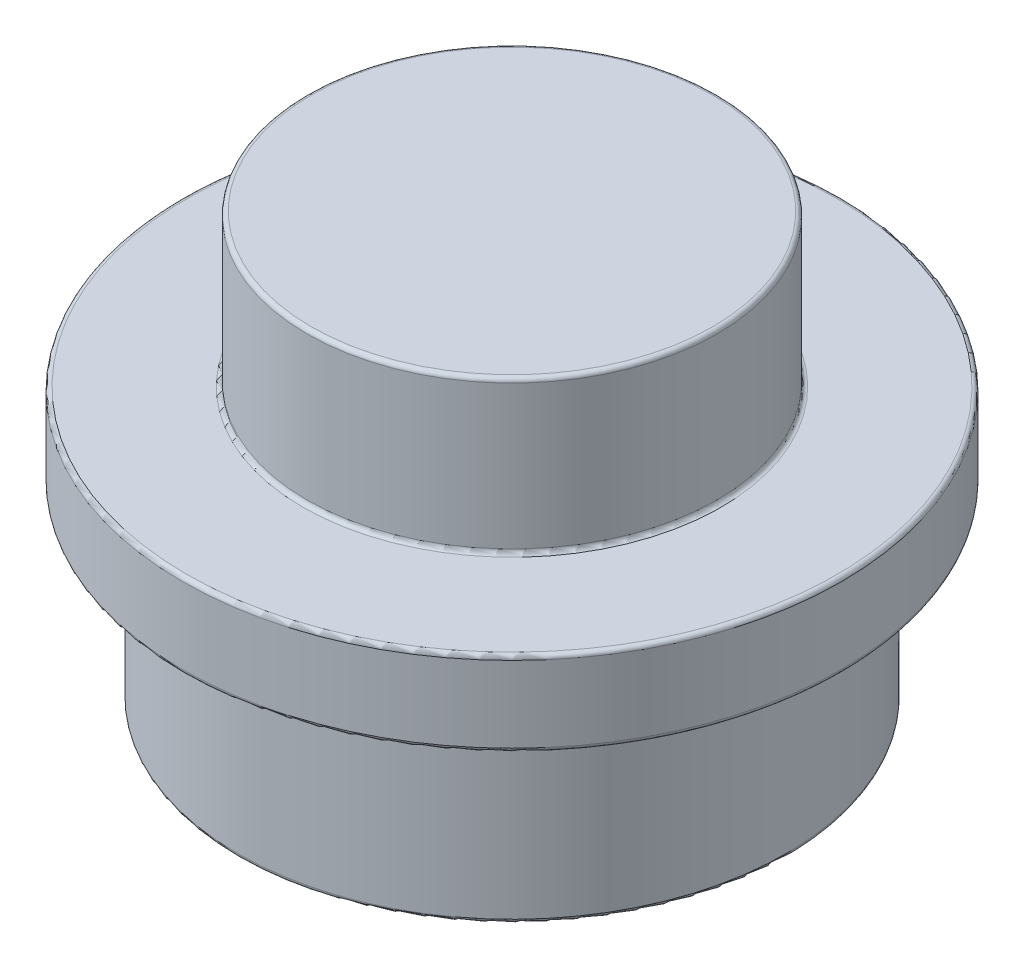
ISO-10303-21;
HEADER;
FILE_DESCRIPTION(('STEP AP214'),'2;1');
FILE_NAME('part.step','',(''),(''),'','','');
FILE_SCHEMA(('AUTOMOTIVE_DESIGN { 1 0 10303 214 1 1 1 1 }'));
ENDSEC;
DATA;
#1=APPLICATION_CONTEXT('core data for automotive mechanical design processes');
#2=APPLICATION_PROTOCOL_DEFINITION('international standard','automotive_design',2000,#1);
#3=PRODUCT_CONTEXT('',#1,'mechanical');
#4=PRODUCT('Part','Part','',(#3));
#5=PRODUCT_RELATED_PRODUCT_CATEGORY('part','',(#4));
#6=PRODUCT_DEFINITION_FORMATION('','',#4);
#7=PRODUCT_DEFINITION_CONTEXT('part definition',#1,'design');
#8=PRODUCT_DEFINITION('design','',#6,#7);
#9=PRODUCT_DEFINITION_SHAPE('','',#8);
#10=(LENGTH_UNIT() NAMED_UNIT(*) SI_UNIT(.MILLI.,.METRE.));
#11=(NAMED_UNIT(*) PLANE_ANGLE_UNIT() SI_UNIT($,.RADIAN.));
#12=(NAMED_UNIT(*) SI_UNIT($,.STERADIAN.) SOLID_ANGLE_UNIT());
#13=UNCERTAINTY_MEASURE_WITH_UNIT(LENGTH_MEASURE(1.E-05),#10,'distance_accuracy_value','');
#14=(GEOMETRIC_REPRESENTATION_CONTEXT(3) GLOBAL_UNCERTAINTY_ASSIGNED_CONTEXT((#13)) GLOBAL_UNIT_ASSIGNED_CONTEXT((#10,
#11,#12)) REPRESENTATION_CONTEXT('',''));
#15=CARTESIAN_POINT('',(0.,0.,0.));
#16=DIRECTION('',(0.,0.,1.));
#17=DIRECTION('',(1.,0.,0.));
#18=AXIS2_PLACEMENT_3D('',#15,#16,#17);
#19=CARTESIAN_POINT('',(0.,0.,0.));
#20=DIRECTION('',(0.,1.,0.));
#21=DIRECTION('',(0.,0.,1.));
#22=AXIS2_PLACEMENT_3D('',#19,#20,#21);
#23=PLANE('',#22);
#24=CARTESIAN_POINT('',(0.,0.,0.));
#25=DIRECTION('',(0.,1.,0.));
#26=DIRECTION('',(0.,0.,1.));
#27=AXIS2_PLACEMENT_3D('',#24,#25,#26);
#28=CIRCLE('',#27,1.74);
#29=CARTESIAN_POINT('',(0.,0.,1.74));
#30=VERTEX_POINT('',#29);
#31=EDGE_CURVE('E86',#30,#30,#28,.T.);
#32=ORIENTED_EDGE('',*,*,#31,.T.);
#33=EDGE_LOOP('',(#32));
#34=FACE_BOUND('',#33,.T.);
#35=CARTESIAN_POINT('',(0.,0.,0.));
#36=DIRECTION('',(0.,1.,0.));
#37=DIRECTION('',(0.,0.,1.));
#38=AXIS2_PLACEMENT_3D('',#35,#36,#37);
#39=CIRCLE('',#38,3.19);
#40=CARTESIAN_POINT('',(0.,0.,3.19));
#41=VERTEX_POINT('',#40);
#42=EDGE_CURVE('E89',#41,#41,#39,.F.);
#43=ORIENTED_EDGE('',*,*,#42,.T.);
#44=EDGE_LOOP('',(#43));
#45=FACE_BOUND('',#44,.T.);
#46=ADVANCED_FACE('F30',(#34,#45),#23,.F.);
#47=CARTESIAN_POINT('',(0.,3.22,0.));
#48=DIRECTION('',(0.,1.,0.));
#49=DIRECTION('',(0.,0.,1.));
#50=AXIS2_PLACEMENT_3D('',#47,#48,#49);
#51=PLANE('',#50);
#52=CARTESIAN_POINT('',(0.,3.22,0.));
#53=DIRECTION('',(0.,1.,0.));
#54=DIRECTION('',(0.,0.,1.));
#55=AXIS2_PLACEMENT_3D('',#52,#53,#54);
#56=CIRCLE('',#55,2.475);
#57=CARTESIAN_POINT('',(0.,3.22,2.475));
#58=VERTEX_POINT('',#57);
#59=EDGE_CURVE('E37',#58,#58,#56,.F.);
#60=ORIENTED_EDGE('',*,*,#59,.T.);
#61=EDGE_LOOP('',(#60));
#62=FACE_BOUND('',#61,.T.);
#63=CARTESIAN_POINT('',(0.,3.22,0.));
#64=DIRECTION('',(0.,1.,0.));
#65=DIRECTION('',(0.,0.,1.));
#66=AXIS2_PLACEMENT_3D('',#63,#64,#65);
#67=CIRCLE('',#66,3.85);
#68=CARTESIAN_POINT('',(0.,3.22,3.85));
#69=VERTEX_POINT('',#68);
#70=EDGE_CURVE('E41',#69,#69,#67,.T.);
#71=ORIENTED_EDGE('',*,*,#70,.T.);
#72=EDGE_LOOP('',(#71));
#73=FACE_BOUND('',#72,.T.);
#74=ADVANCED_FACE('F125',(#62,#73),#51,.T.);
#75=CARTESIAN_POINT('',(0.,3.22,0.));
#76=DIRECTION('',(0.,-1.,0.));
#77=DIRECTION('',(0.,0.,-1.));
#78=AXIS2_PLACEMENT_3D('',#75,#76,#77);
#79=CYLINDRICAL_SURFACE('',#78,3.9);
#80=CARTESIAN_POINT('',(0.,2.27,0.));
#81=DIRECTION('',(0.,1.,0.));
#82=DIRECTION('',(0.,0.,1.));
#83=AXIS2_PLACEMENT_3D('',#80,#81,#82);
#84=CIRCLE('',#83,3.9);
#85=CARTESIAN_POINT('',(0.,2.27,-3.9));
#86=VERTEX_POINT('',#85);
#87=EDGE_CURVE('E59',#86,#86,#84,.T.);
#88=CARTESIAN_POINT('',(0.,3.17,0.));
#89=DIRECTION('',(0.,1.,0.));
#90=DIRECTION('',(0.,0.,1.));
#91=AXIS2_PLACEMENT_3D('',#88,#89,#90);
#92=CIRCLE('',#91,3.9);
#93=CARTESIAN_POINT('',(0.,3.17,-3.9));
#94=VERTEX_POINT('',#93);
#95=EDGE_CURVE('E62',#94,#94,#92,.F.);
#96=CARTESIAN_POINT('',(0.,2.27,-3.9));
#97=CARTESIAN_POINT('',(0.,2.279375,-3.9));
#98=CARTESIAN_POINT('',(0.,2.28875,-3.9));
#99=CARTESIAN_POINT('',(0.,2.3075,-3.9));
#100=CARTESIAN_POINT('',(0.,2.316875,-3.9));
#101=CARTESIAN_POINT('',(0.,2.335625,-3.9));
#102=CARTESIAN_POINT('',(0.,2.345,-3.9));
#103=CARTESIAN_POINT('',(0.,2.36375,-3.9));
#104=CARTESIAN_POINT('',(0.,2.373125,-3.9));
#105=CARTESIAN_POINT('',(0.,2.391875,-3.9));
#106=CARTESIAN_POINT('',(0.,2.40125,-3.9));
#107=CARTESIAN_POINT('',(0.,2.42,-3.9));
#108=CARTESIAN_POINT('',(0.,2.429375,-3.9));
#109=CARTESIAN_POINT('',(0.,2.448125,-3.9));
#110=CARTESIAN_POINT('',(0.,2.4575,-3.9));
#111=CARTESIAN_POINT('',(0.,2.47625,-3.9));
#112=CARTESIAN_POINT('',(0.,2.485625,-3.9));
#113=CARTESIAN_POINT('',(0.,2.504375,-3.9));
#114=CARTESIAN_POINT('',(0.,2.51375,-3.9));
#115=CARTESIAN_POINT('',(0.,2.5325,-3.9));
#116=CARTESIAN_POINT('',(0.,2.541875,-3.9));
#117=CARTESIAN_POINT('',(0.,2.560625,-3.9));
#118=CARTESIAN_POINT('',(0.,2.57,-3.9));
#119=CARTESIAN_POINT('',(0.,2.58875,-3.9));
#120=CARTESIAN_POINT('',(0.,2.598125,-3.9));
#121=CARTESIAN_POINT('',(0.,2.616875,-3.9));
#122=CARTESIAN_POINT('',(0.,2.62625,-3.9));
#123=CARTESIAN_POINT('',(0.,2.645,-3.9));
#124=CARTESIAN_POINT('',(0.,2.654375,-3.9));
#125=CARTESIAN_POINT('',(0.,2.673125,-3.9));
#126=CARTESIAN_POINT('',(0.,2.6825,-3.9));
#127=CARTESIAN_POINT('',(0.,2.70125,-3.9));
#128=CARTESIAN_POINT('',(0.,2.710625,-3.9));
#129=CARTESIAN_POINT('',(0.,2.729375,-3.9));
#130=CARTESIAN_POINT('',(0.,2.73875,-3.9));
#131=CARTESIAN_POINT('',(0.,2.7575,-3.9));
#132=CARTESIAN_POINT('',(0.,2.766875,-3.9));
#133=CARTESIAN_POINT('',(0.,2.785625,-3.9));
#134=CARTESIAN_POINT('',(0.,2.795,-3.9));
#135=CARTESIAN_POINT('',(0.,2.81375,-3.9));
#136=CARTESIAN_POINT('',(0.,2.823125,-3.9));
#137=CARTESIAN_POINT('',(0.,2.841875,-3.9));
#138=CARTESIAN_POINT('',(0.,2.85125,-3.9));
#139=CARTESIAN_POINT('',(0.,2.87,-3.9));
#140=CARTESIAN_POINT('',(0.,2.879375,-3.9));
#141=CARTESIAN_POINT('',(0.,2.898125,-3.9));
#142=CARTESIAN_POINT('',(0.,2.9075,-3.9));
#143=CARTESIAN_POINT('',(0.,2.92625,-3.9));
#144=CARTESIAN_POINT('',(0.,2.935625,-3.9));
#145=CARTESIAN_POINT('',(0.,2.954375,-3.9));
#146=CARTESIAN_POINT('',(0.,2.96375,-3.9));
#147=CARTESIAN_POINT('',(0.,2.9825,-3.9));
#148=CARTESIAN_POINT('',(0.,2.991875,-3.9));
#149=CARTESIAN_POINT('',(0.,3.010625,-3.9));
#150=CARTESIAN_POINT('',(0.,3.02,-3.9));
#151=CARTESIAN_POINT('',(0.,3.03875,-3.9));
#152=CARTESIAN_POINT('',(0.,3.048125,-3.9));
#153=CARTESIAN_POINT('',(0.,3.066875,-3.9));
#154=CARTESIAN_POINT('',(0.,3.07625,-3.9));
#155=CARTESIAN_POINT('',(0.,3.095,-3.9));
#156=CARTESIAN_POINT('',(0.,3.104375,-3.9));
#157=CARTESIAN_POINT('',(0.,3.123125,-3.9));
#158=CARTESIAN_POINT('',(0.,3.1325,-3.9));
#159=CARTESIAN_POINT('',(0.,3.15125,-3.9));
#160=CARTESIAN_POINT('',(0.,3.160625,-3.9));
#161=CARTESIAN_POINT('',(0.,3.17,-3.9));
#162=B_SPLINE_CURVE_WITH_KNOTS('',3,(#96,#97,#98,#99,#100,#101,#102,#103,#104,#105,#106,#107,
#108,#109,#110,#111,#112,#113,#114,#115,#116,#117,#118,#119,#120,#121,#122,#123,#124,#125,#126,
#127,#128,#129,#130,#131,#132,#133,#134,#135,#136,#137,#138,#139,#140,#141,#142,#143,#144,#145,
#146,#147,#148,#149,#150,#151,#152,#153,#154,#155,#156,#157,#158,#159,#160,#161),.UNSPECIFIED.,
.F.,.F.,(4,2,2,2,2,2,2,2,2,2,2,2,2,2,2,2,2,2,2,2,2,2,2,2,2,2,2,2,2,2,2,2,4),(0.,
0.0281249999999999,0.0562500000000003,0.0843750000000003,0.1125,0.140625,0.16875,0.196875,0.225,
0.253125,0.28125,0.309375,0.3375,0.365625,0.39375,0.421875,0.45,0.478125,0.50625,0.534375,
0.5625,0.590625,0.61875,0.646875,0.675,0.703125,0.73125,0.759375,0.7875,0.815625,0.84375,
0.871875,0.9),.UNSPECIFIED.);
#163=EDGE_CURVE('BSEAM131',#86,#94,#162,.T.);
#164=ORIENTED_EDGE('',*,*,#87,.T.);
#165=ORIENTED_EDGE('',*,*,#95,.T.);
#166=ORIENTED_EDGE('',*,*,#163,.T.);
#167=ORIENTED_EDGE('',*,*,#163,.F.);
#168=EDGE_LOOP('',(#164,#166,#165,#167));
#169=FACE_BOUND('',#168,.T.);
#170=ADVANCED_FACE('F131',(#169),#79,.T.);
#171=CARTESIAN_POINT('',(0.,5.02,0.));
#172=DIRECTION('',(0.,-1.,0.));
#173=DIRECTION('',(0.,0.,-1.));
#174=AXIS2_PLACEMENT_3D('',#171,#172,#173);
#175=CYLINDRICAL_SURFACE('',#174,2.425);
#176=CARTESIAN_POINT('',(0.,3.27,0.));
#177=DIRECTION('',(0.,1.,0.));
#178=DIRECTION('',(0.,0.,1.));
#179=AXIS2_PLACEMENT_3D('',#176,#177,#178);
#180=CIRCLE('',#179,2.425);
#181=CARTESIAN_POINT('',(0.,3.27,2.425));
#182=VERTEX_POINT('',#181);
#183=EDGE_CURVE('E45',#182,#182,#180,.T.);
#184=ORIENTED_EDGE('',*,*,#183,.T.);
#185=EDGE_LOOP('',(#184));
#186=FACE_BOUND('',#185,.T.);
#187=CARTESIAN_POINT('',(0.,4.97,0.));
#188=DIRECTION('',(0.,1.,0.));
#189=DIRECTION('',(0.,0.,1.));
#190=AXIS2_PLACEMENT_3D('',#187,#188,#189);
#191=CIRCLE('',#190,2.425);
#192=CARTESIAN_POINT('',(0.,4.97,2.425));
#193=VERTEX_POINT('',#192);
#194=EDGE_CURVE('E50',#193,#193,#191,.F.);
#195=ORIENTED_EDGE('',*,*,#194,.T.);
#196=EDGE_LOOP('',(#195));
#197=FACE_BOUND('',#196,.T.);
#198=ADVANCED_FACE('F138',(#186,#197),#175,.T.);
#199=CARTESIAN_POINT('',(0.,5.02,0.));
#200=DIRECTION('',(0.,1.,0.));
#201=DIRECTION('',(0.,0.,1.));
#202=AXIS2_PLACEMENT_3D('',#199,#200,#201);
#203=PLANE('',#202);
#204=CARTESIAN_POINT('',(0.,5.02,0.));
#205=DIRECTION('',(0.,1.,0.));
#206=DIRECTION('',(0.,0.,1.));
#207=AXIS2_PLACEMENT_3D('',#204,#205,#206);
#208=CIRCLE('',#207,2.375);
#209=CARTESIAN_POINT('',(0.,5.02,2.375));
#210=VERTEX_POINT('',#209);
#211=EDGE_CURVE('E11',#210,#210,#208,.T.);
#212=ORIENTED_EDGE('',*,*,#211,.T.);
#213=EDGE_LOOP('',(#212));
#214=FACE_BOUND('',#213,.T.);
#215=ADVANCED_FACE('F176',(#214),#203,.T.);
#216=CARTESIAN_POINT('',(0.,14.2508657865101,0.));
#217=DIRECTION('',(0.,-1.,0.));
#218=DIRECTION('',(0.,0.,-1.));
#219=AXIS2_PLACEMENT_3D('',#216,#217,#218);
#220=CYLINDRICAL_SURFACE('',#219,3.24);
#221=CARTESIAN_POINT('',(0.,0.0499999999999997,0.));
#222=DIRECTION('',(0.,1.,0.));
#223=DIRECTION('',(0.,0.,1.));
#224=AXIS2_PLACEMENT_3D('',#221,#222,#223);
#225=CIRCLE('',#224,3.24);
#226=CARTESIAN_POINT('',(0.,0.0499999999999997,3.24));
#227=VERTEX_POINT('',#226);
#228=EDGE_CURVE('E53',#227,#227,#225,.T.);
#229=ORIENTED_EDGE('',*,*,#228,.T.);
#230=EDGE_LOOP('',(#229));
#231=FACE_BOUND('',#230,.T.);
#232=CARTESIAN_POINT('',(0.,2.17,0.));
#233=DIRECTION('',(0.,1.,0.));
#234=DIRECTION('',(0.,0.,1.));
#235=AXIS2_PLACEMENT_3D('',#232,#233,#234);
#236=CIRCLE('',#235,3.24);
#237=CARTESIAN_POINT('',(0.,2.17,3.24));
#238=VERTEX_POINT('',#237);
#239=EDGE_CURVE('E56',#238,#238,#236,.F.);
#240=ORIENTED_EDGE('',*,*,#239,.T.);
#241=EDGE_LOOP('',(#240));
#242=FACE_BOUND('',#241,.T.);
#243=ADVANCED_FACE('F181',(#231,#242),#220,.T.);
#244=CARTESIAN_POINT('',(0.,2.22,0.));
#245=DIRECTION('',(0.,1.,0.));
#246=DIRECTION('',(0.,0.,1.));
#247=AXIS2_PLACEMENT_3D('',#244,#245,#246);
#248=PLANE('',#247);
#249=CARTESIAN_POINT('',(0.,2.22,0.));
#250=DIRECTION('',(0.,1.,0.));
#251=DIRECTION('',(0.,0.,1.));
#252=AXIS2_PLACEMENT_3D('',#249,#250,#251);
#253=CIRCLE('',#252,3.85);
#254=CARTESIAN_POINT('',(0.,2.22,3.85));
#255=VERTEX_POINT('',#254);
#256=EDGE_CURVE('E65',#255,#255,#253,.F.);
#257=ORIENTED_EDGE('',*,*,#256,.T.);
#258=EDGE_LOOP('',(#257));
#259=FACE_BOUND('',#258,.T.);
#260=CARTESIAN_POINT('',(0.,2.22,0.));
#261=DIRECTION('',(0.,1.,0.));
#262=DIRECTION('',(0.,0.,1.));
#263=AXIS2_PLACEMENT_3D('',#260,#261,#262);
#264=CIRCLE('',#263,3.29);
#265=CARTESIAN_POINT('',(0.,2.22,3.29));
#266=VERTEX_POINT('',#265);
#267=EDGE_CURVE('E68',#266,#266,#264,.T.);
#268=ORIENTED_EDGE('',*,*,#267,.T.);
#269=EDGE_LOOP('',(#268));
#270=FACE_BOUND('',#269,.T.);
#271=ADVANCED_FACE('F121',(#259,#270),#248,.F.);
#272=CARTESIAN_POINT('',(0.,14.2508657865101,0.));
#273=DIRECTION('',(0.,-1.,0.));
#274=DIRECTION('',(0.,0.,-1.));
#275=AXIS2_PLACEMENT_3D('',#272,#273,#274);
#276=CYLINDRICAL_SURFACE('',#275,1.69);
#277=CARTESIAN_POINT('',(0.,0.0499999999999997,0.));
#278=DIRECTION('',(0.,1.,0.));
#279=DIRECTION('',(0.,0.,1.));
#280=AXIS2_PLACEMENT_3D('',#277,#278,#279);
#281=CIRCLE('',#280,1.69);
#282=CARTESIAN_POINT('',(0.,0.0499999999999997,1.69));
#283=VERTEX_POINT('',#282);
#284=EDGE_CURVE('E92',#283,#283,#281,.F.);
#285=ORIENTED_EDGE('',*,*,#284,.T.);
#286=EDGE_LOOP('',(#285));
#287=FACE_BOUND('',#286,.T.);
#288=CARTESIAN_POINT('',(0.,1.62,0.));
#289=DIRECTION('',(0.,1.,0.));
#290=DIRECTION('',(0.,0.,1.));
#291=AXIS2_PLACEMENT_3D('',#288,#289,#290);
#292=CIRCLE('',#291,1.69);
#293=CARTESIAN_POINT('',(0.,1.62,1.69));
#294=VERTEX_POINT('',#293);
#295=EDGE_CURVE('E95',#294,#294,#292,.T.);
#296=ORIENTED_EDGE('',*,*,#295,.T.);
#297=EDGE_LOOP('',(#296));
#298=FACE_BOUND('',#297,.T.);
#299=ADVANCED_FACE('F99',(#287,#298),#276,.F.);
#300=CARTESIAN_POINT('',(0.,1.67,0.));
#301=DIRECTION('',(0.,1.,0.));
#302=DIRECTION('',(0.,0.,1.));
#303=AXIS2_PLACEMENT_3D('',#300,#301,#302);
#304=PLANE('',#303);
#305=CARTESIAN_POINT('',(0.,1.67,0.));
#306=DIRECTION('',(0.,1.,0.));
#307=DIRECTION('',(0.,0.,1.));
#308=AXIS2_PLACEMENT_3D('',#305,#306,#307);
#309=CIRCLE('',#308,0.925);
#310=CARTESIAN_POINT('',(0.,1.67,0.925));
#311=VERTEX_POINT('',#310);
#312=EDGE_CURVE('E80',#311,#311,#309,.T.);
#313=ORIENTED_EDGE('',*,*,#312,.T.);
#314=EDGE_LOOP('',(#313));
#315=FACE_BOUND('',#314,.T.);
#316=CARTESIAN_POINT('',(0.,1.67,0.));
#317=DIRECTION('',(0.,1.,0.));
#318=DIRECTION('',(0.,0.,1.));
#319=AXIS2_PLACEMENT_3D('',#316,#317,#318);
#320=CIRCLE('',#319,1.64);
#321=CARTESIAN_POINT('',(0.,1.67,1.64));
#322=VERTEX_POINT('',#321);
#323=EDGE_CURVE('E83',#322,#322,#320,.F.);
#324=ORIENTED_EDGE('',*,*,#323,.T.);
#325=EDGE_LOOP('',(#324));
#326=FACE_BOUND('',#325,.T.);
#327=ADVANCED_FACE('F109',(#315,#326),#304,.F.);
#328=CARTESIAN_POINT('',(0.,5.02,0.));
#329=DIRECTION('',(0.,-1.,0.));
#330=DIRECTION('',(0.,0.,-1.));
#331=AXIS2_PLACEMENT_3D('',#328,#329,#330);
#332=CYLINDRICAL_SURFACE('',#331,0.875);
#333=CARTESIAN_POINT('',(0.,1.72,0.));
#334=DIRECTION('',(0.,1.,0.));
#335=DIRECTION('',(0.,0.,1.));
#336=AXIS2_PLACEMENT_3D('',#333,#334,#335);
#337=CIRCLE('',#336,0.875);
#338=CARTESIAN_POINT('',(0.,1.72,0.875));
#339=VERTEX_POINT('',#338);
#340=EDGE_CURVE('E74',#339,#339,#337,.F.);
#341=ORIENTED_EDGE('',*,*,#340,.T.);
#342=EDGE_LOOP('',(#341));
#343=FACE_BOUND('',#342,.T.);
#344=CARTESIAN_POINT('',(0.,3.42,0.));
#345=DIRECTION('',(0.,1.,0.));
#346=DIRECTION('',(0.,0.,1.));
#347=AXIS2_PLACEMENT_3D('',#344,#345,#346);
#348=CIRCLE('',#347,0.875);
#349=CARTESIAN_POINT('',(0.,3.42,0.875));
#350=VERTEX_POINT('',#349);
#351=EDGE_CURVE('E77',#350,#350,#348,.T.);
#352=ORIENTED_EDGE('',*,*,#351,.T.);
#353=EDGE_LOOP('',(#352));
#354=FACE_BOUND('',#353,.T.);
#355=ADVANCED_FACE('F111',(#343,#354),#332,.F.);
#356=CARTESIAN_POINT('',(0.,3.47,0.));
#357=DIRECTION('',(0.,1.,0.));
#358=DIRECTION('',(0.,0.,1.));
#359=AXIS2_PLACEMENT_3D('',#356,#357,#358);
#360=PLANE('',#359);
#361=CARTESIAN_POINT('',(0.,3.47,0.));
#362=DIRECTION('',(0.,1.,0.));
#363=DIRECTION('',(0.,0.,1.));
#364=AXIS2_PLACEMENT_3D('',#361,#362,#363);
#365=CIRCLE('',#364,0.825);
#366=CARTESIAN_POINT('',(0.,3.47,0.825));
#367=VERTEX_POINT('',#366);
#368=EDGE_CURVE('E71',#367,#367,#365,.F.);
#369=ORIENTED_EDGE('',*,*,#368,.T.);
#370=EDGE_LOOP('',(#369));
#371=FACE_BOUND('',#370,.T.);
#372=ADVANCED_FACE('F118',(#371),#360,.F.);
#373=CARTESIAN_POINT('',(0.,0.0499999999999997,0.));
#374=DIRECTION('',(0.,1.,0.));
#375=DIRECTION('',(0.,0.,1.));
#376=AXIS2_PLACEMENT_3D('',#373,#374,#375);
#377=TOROIDAL_SURFACE('',#376,1.74,0.05);
#378=ORIENTED_EDGE('',*,*,#31,.F.);
#379=EDGE_LOOP('',(#378));
#380=FACE_BOUND('',#379,.T.);
#381=ORIENTED_EDGE('',*,*,#284,.F.);
#382=EDGE_LOOP('',(#381));
#383=FACE_BOUND('',#382,.T.);
#384=ADVANCED_FACE('F140',(#380,#383),#377,.T.);
#385=CARTESIAN_POINT('',(0.,1.72,0.));
#386=DIRECTION('',(0.,1.,0.));
#387=DIRECTION('',(0.,0.,1.));
#388=AXIS2_PLACEMENT_3D('',#385,#386,#387);
#389=TOROIDAL_SURFACE('',#388,0.925,0.05);
#390=ORIENTED_EDGE('',*,*,#340,.F.);
#391=EDGE_LOOP('',(#390));
#392=FACE_BOUND('',#391,.T.);
#393=ORIENTED_EDGE('',*,*,#312,.F.);
#394=EDGE_LOOP('',(#393));
#395=FACE_BOUND('',#394,.T.);
#396=ADVANCED_FACE('F143',(#392,#395),#389,.T.);
#397=CARTESIAN_POINT('',(0.,3.42,0.));
#398=DIRECTION('',(0.,1.,0.));
#399=DIRECTION('',(0.,0.,1.));
#400=AXIS2_PLACEMENT_3D('',#397,#398,#399);
#401=TOROIDAL_SURFACE('',#400,0.825,0.05);
#402=ORIENTED_EDGE('',*,*,#368,.F.);
#403=EDGE_LOOP('',(#402));
#404=FACE_BOUND('',#403,.T.);
#405=ORIENTED_EDGE('',*,*,#351,.F.);
#406=EDGE_LOOP('',(#405));
#407=FACE_BOUND('',#406,.T.);
#408=ADVANCED_FACE('F105',(#404,#407),#401,.F.);
#409=CARTESIAN_POINT('',(0.,1.62,0.));
#410=DIRECTION('',(0.,1.,0.));
#411=DIRECTION('',(0.,0.,1.));
#412=AXIS2_PLACEMENT_3D('',#409,#410,#411);
#413=TOROIDAL_SURFACE('',#412,1.64,0.05);
#414=ORIENTED_EDGE('',*,*,#295,.F.);
#415=EDGE_LOOP('',(#414));
#416=FACE_BOUND('',#415,.T.);
#417=ORIENTED_EDGE('',*,*,#323,.F.);
#418=EDGE_LOOP('',(#417));
#419=FACE_BOUND('',#418,.T.);
#420=ADVANCED_FACE('F101',(#416,#419),#413,.F.);
#421=CARTESIAN_POINT('',(0.,2.27,0.));
#422=DIRECTION('',(0.,1.,0.));
#423=DIRECTION('',(0.,0.,1.));
#424=AXIS2_PLACEMENT_3D('',#421,#422,#423);
#425=TOROIDAL_SURFACE('',#424,3.85,0.05);
#426=ORIENTED_EDGE('',*,*,#87,.F.);
#427=EDGE_LOOP('',(#426));
#428=FACE_BOUND('',#427,.T.);
#429=ORIENTED_EDGE('',*,*,#256,.F.);
#430=EDGE_LOOP('',(#429));
#431=FACE_BOUND('',#430,.T.);
#432=ADVANCED_FACE('F104',(#428,#431),#425,.T.);
#433=CARTESIAN_POINT('',(0.,0.0499999999999997,0.));
#434=DIRECTION('',(0.,1.,0.));
#435=DIRECTION('',(0.,0.,1.));
#436=AXIS2_PLACEMENT_3D('',#433,#434,#435);
#437=TOROIDAL_SURFACE('',#436,3.19,0.05);
#438=ORIENTED_EDGE('',*,*,#228,.F.);
#439=EDGE_LOOP('',(#438));
#440=FACE_BOUND('',#439,.T.);
#441=ORIENTED_EDGE('',*,*,#42,.F.);
#442=EDGE_LOOP('',(#441));
#443=FACE_BOUND('',#442,.T.);
#444=ADVANCED_FACE('F153',(#440,#443),#437,.T.);
#445=CARTESIAN_POINT('',(0.,2.17,0.));
#446=DIRECTION('',(0.,1.,0.));
#447=DIRECTION('',(0.,0.,1.));
#448=AXIS2_PLACEMENT_3D('',#445,#446,#447);
#449=TOROIDAL_SURFACE('',#448,3.29,0.05);
#450=ORIENTED_EDGE('',*,*,#267,.F.);
#451=EDGE_LOOP('',(#450));
#452=FACE_BOUND('',#451,.T.);
#453=ORIENTED_EDGE('',*,*,#239,.F.);
#454=EDGE_LOOP('',(#453));
#455=FACE_BOUND('',#454,.T.);
#456=ADVANCED_FACE('F157',(#452,#455),#449,.F.);
#457=CARTESIAN_POINT('',(0.,3.27,0.));
#458=DIRECTION('',(0.,1.,0.));
#459=DIRECTION('',(0.,0.,1.));
#460=AXIS2_PLACEMENT_3D('',#457,#458,#459);
#461=TOROIDAL_SURFACE('',#460,2.475,0.05);
#462=ORIENTED_EDGE('',*,*,#59,.F.);
#463=EDGE_LOOP('',(#462));
#464=FACE_BOUND('',#463,.T.);
#465=ORIENTED_EDGE('',*,*,#183,.F.);
#466=EDGE_LOOP('',(#465));
#467=FACE_BOUND('',#466,.T.);
#468=ADVANCED_FACE('F161',(#464,#467),#461,.F.);
#469=CARTESIAN_POINT('',(0.,4.97,0.));
#470=DIRECTION('',(0.,1.,0.));
#471=DIRECTION('',(0.,0.,1.));
#472=AXIS2_PLACEMENT_3D('',#469,#470,#471);
#473=TOROIDAL_SURFACE('',#472,2.375,0.05);
#474=ORIENTED_EDGE('',*,*,#194,.F.);
#475=EDGE_LOOP('',(#474));
#476=FACE_BOUND('',#475,.T.);
#477=ORIENTED_EDGE('',*,*,#211,.F.);
#478=EDGE_LOOP('',(#477));
#479=FACE_BOUND('',#478,.T.);
#480=ADVANCED_FACE('F164',(#476,#479),#473,.T.);
#481=CARTESIAN_POINT('',(0.,3.17,0.));
#482=DIRECTION('',(0.,1.,0.));
#483=DIRECTION('',(0.,0.,1.));
#484=AXIS2_PLACEMENT_3D('',#481,#482,#483);
#485=TOROIDAL_SURFACE('',#484,3.85,0.05);
#486=ORIENTED_EDGE('',*,*,#95,.F.);
#487=EDGE_LOOP('',(#486));
#488=FACE_BOUND('',#487,.T.);
#489=ORIENTED_EDGE('',*,*,#70,.F.);
#490=EDGE_LOOP('',(#489));
#491=FACE_BOUND('',#490,.T.);
#492=ADVANCED_FACE('F32',(#488,#491),#485,.T.);
#493=CLOSED_SHELL('',(#46,#74,#170,#198,#215,#243,#271,#299,#327,#355,#372,#384,#396,#408,#420,
#432,#444,#456,#468,#480,#492));
#494=MANIFOLD_SOLID_BREP('B2',#493);
#495=ADVANCED_BREP_SHAPE_REPRESENTATION('',(#18,#494),#14);
#496=SHAPE_DEFINITION_REPRESENTATION(#9,#495);
ENDSEC;
END-ISO-10303-21;
